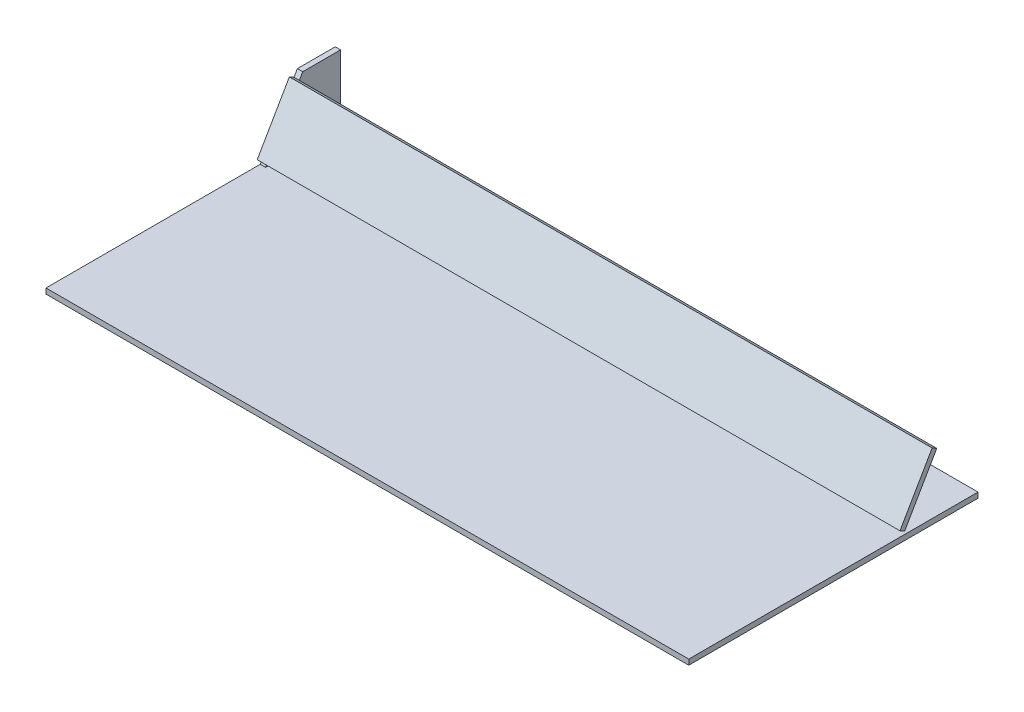
ISO-10303-21;
HEADER;
FILE_DESCRIPTION(('STEP AP214'),'2;1');
FILE_NAME('part.step','',(''),(''),'','','');
FILE_SCHEMA(('AUTOMOTIVE_DESIGN { 1 0 10303 214 1 1 1 1 }'));
ENDSEC;
DATA;
#1=APPLICATION_CONTEXT('core data for automotive mechanical design processes');
#2=APPLICATION_PROTOCOL_DEFINITION('international standard','automotive_design',2000,#1);
#3=PRODUCT_CONTEXT('',#1,'mechanical');
#4=PRODUCT('Part','Part','',(#3));
#5=PRODUCT_RELATED_PRODUCT_CATEGORY('part','',(#4));
#6=PRODUCT_DEFINITION_FORMATION('','',#4);
#7=PRODUCT_DEFINITION_CONTEXT('part definition',#1,'design');
#8=PRODUCT_DEFINITION('design','',#6,#7);
#9=PRODUCT_DEFINITION_SHAPE('','',#8);
#10=(LENGTH_UNIT() NAMED_UNIT(*) SI_UNIT(.MILLI.,.METRE.));
#11=(NAMED_UNIT(*) PLANE_ANGLE_UNIT() SI_UNIT($,.RADIAN.));
#12=(NAMED_UNIT(*) SI_UNIT($,.STERADIAN.) SOLID_ANGLE_UNIT());
#13=UNCERTAINTY_MEASURE_WITH_UNIT(LENGTH_MEASURE(1.E-05),#10,'distance_accuracy_value','');
#14=(GEOMETRIC_REPRESENTATION_CONTEXT(3) GLOBAL_UNCERTAINTY_ASSIGNED_CONTEXT((#13)) GLOBAL_UNIT_ASSIGNED_CONTEXT((#10,
#11,#12)) REPRESENTATION_CONTEXT('',''));
#15=CARTESIAN_POINT('',(0.,0.,0.));
#16=DIRECTION('',(0.,0.,1.));
#17=DIRECTION('',(1.,0.,0.));
#18=AXIS2_PLACEMENT_3D('',#15,#16,#17);
#19=CARTESIAN_POINT('',(-300.,5.,-135.));
#20=DIRECTION('',(1.,0.,0.));
#21=DIRECTION('',(0.,0.,-1.));
#22=AXIS2_PLACEMENT_3D('',#19,#20,#21);
#23=PLANE('',#22);
#24=DIRECTION('',(0.,0.,1.));
#25=VECTOR('',#24,1.);
#26=CARTESIAN_POINT('',(-300.,0.,-135.));
#27=LINE('',#26,#25);
#28=CARTESIAN_POINT('',(-300.,0.,-135.));
#29=VERTEX_POINT('',#28);
#30=CARTESIAN_POINT('',(-300.,0.,135.));
#31=VERTEX_POINT('',#30);
#32=EDGE_CURVE('E108',#29,#31,#27,.T.);
#33=ORIENTED_EDGE('',*,*,#32,.T.);
#34=DIRECTION('',(0.,-1.,0.));
#35=VECTOR('',#34,1.);
#36=CARTESIAN_POINT('',(-300.,5.,135.));
#37=LINE('',#36,#35);
#38=CARTESIAN_POINT('',(-300.,5.,135.));
#39=VERTEX_POINT('',#38);
#40=EDGE_CURVE('E12',#39,#31,#37,.T.);
#41=ORIENTED_EDGE('',*,*,#40,.F.);
#42=DIRECTION('',(0.,0.,1.));
#43=VECTOR('',#42,1.);
#44=CARTESIAN_POINT('',(-300.,5.,-135.));
#45=LINE('',#44,#43);
#46=CARTESIAN_POINT('',(-300.,5.,-135.));
#47=VERTEX_POINT('',#46);
#48=EDGE_CURVE('E96',#47,#39,#45,.T.);
#49=ORIENTED_EDGE('',*,*,#48,.F.);
#50=DIRECTION('',(0.,-1.,0.));
#51=VECTOR('',#50,1.);
#52=CARTESIAN_POINT('',(-300.,5.,-135.));
#53=LINE('',#52,#51);
#54=EDGE_CURVE('E104',#47,#29,#53,.T.);
#55=ORIENTED_EDGE('',*,*,#54,.T.);
#56=EDGE_LOOP('',(#33,#41,#49,#55));
#57=FACE_BOUND('',#56,.T.);
#58=ADVANCED_FACE('F45',(#57),#23,.F.);
#59=CARTESIAN_POINT('',(-300.,5.,135.));
#60=DIRECTION('',(0.,0.,-1.));
#61=DIRECTION('',(-1.,0.,0.));
#62=AXIS2_PLACEMENT_3D('',#59,#60,#61);
#63=PLANE('',#62);
#64=DIRECTION('',(1.,0.,0.));
#65=VECTOR('',#64,1.);
#66=CARTESIAN_POINT('',(-300.,0.,135.));
#67=LINE('',#66,#65);
#68=CARTESIAN_POINT('',(300.,0.,135.));
#69=VERTEX_POINT('',#68);
#70=EDGE_CURVE('E100',#31,#69,#67,.T.);
#71=ORIENTED_EDGE('',*,*,#70,.T.);
#72=DIRECTION('',(0.,-1.,0.));
#73=VECTOR('',#72,1.);
#74=CARTESIAN_POINT('',(300.,5.,135.));
#75=LINE('',#74,#73);
#76=CARTESIAN_POINT('',(300.,5.,135.));
#77=VERTEX_POINT('',#76);
#78=EDGE_CURVE('E53',#77,#69,#75,.T.);
#79=ORIENTED_EDGE('',*,*,#78,.F.);
#80=DIRECTION('',(1.,0.,0.));
#81=VECTOR('',#80,1.);
#82=CARTESIAN_POINT('',(-300.,5.,135.));
#83=LINE('',#82,#81);
#84=EDGE_CURVE('E91',#39,#77,#83,.T.);
#85=ORIENTED_EDGE('',*,*,#84,.F.);
#86=ORIENTED_EDGE('',*,*,#40,.T.);
#87=EDGE_LOOP('',(#71,#79,#85,#86));
#88=FACE_BOUND('',#87,.T.);
#89=ADVANCED_FACE('F99',(#88),#63,.F.);
#90=CARTESIAN_POINT('',(300.,5.,-135.));
#91=DIRECTION('',(-1.,0.,0.));
#92=DIRECTION('',(0.,0.,1.));
#93=AXIS2_PLACEMENT_3D('',#90,#91,#92);
#94=PLANE('',#93);
#95=DIRECTION('',(0.,0.,-1.));
#96=VECTOR('',#95,1.);
#97=CARTESIAN_POINT('',(300.,0.,-135.));
#98=LINE('',#97,#96);
#99=CARTESIAN_POINT('',(300.,0.,-135.));
#100=VERTEX_POINT('',#99);
#101=EDGE_CURVE('E78',#69,#100,#98,.T.);
#102=ORIENTED_EDGE('',*,*,#101,.T.);
#103=DIRECTION('',(0.,-1.,0.));
#104=VECTOR('',#103,1.);
#105=CARTESIAN_POINT('',(300.,5.,-135.));
#106=LINE('',#105,#104);
#107=CARTESIAN_POINT('',(300.,5.,-135.));
#108=VERTEX_POINT('',#107);
#109=EDGE_CURVE('E101',#108,#100,#106,.T.);
#110=ORIENTED_EDGE('',*,*,#109,.F.);
#111=DIRECTION('',(0.,0.,-1.));
#112=VECTOR('',#111,1.);
#113=CARTESIAN_POINT('',(300.,5.,-135.));
#114=LINE('',#113,#112);
#115=EDGE_CURVE('E94',#77,#108,#114,.T.);
#116=ORIENTED_EDGE('',*,*,#115,.F.);
#117=ORIENTED_EDGE('',*,*,#78,.T.);
#118=EDGE_LOOP('',(#102,#110,#116,#117));
#119=FACE_BOUND('',#118,.T.);
#120=ADVANCED_FACE('F102',(#119),#94,.F.);
#121=CARTESIAN_POINT('',(-300.,5.,-135.));
#122=DIRECTION('',(0.,0.,1.));
#123=DIRECTION('',(1.,0.,0.));
#124=AXIS2_PLACEMENT_3D('',#121,#122,#123);
#125=PLANE('',#124);
#126=DIRECTION('',(-1.,0.,0.));
#127=VECTOR('',#126,1.);
#128=CARTESIAN_POINT('',(-300.,0.,-135.));
#129=LINE('',#128,#127);
#130=EDGE_CURVE('E84',#100,#29,#129,.T.);
#131=ORIENTED_EDGE('',*,*,#130,.T.);
#132=ORIENTED_EDGE('',*,*,#54,.F.);
#133=DIRECTION('',(-1.,0.,0.));
#134=VECTOR('',#133,1.);
#135=CARTESIAN_POINT('',(-300.,5.,-135.));
#136=LINE('',#135,#134);
#137=EDGE_CURVE('E61',#108,#47,#136,.T.);
#138=ORIENTED_EDGE('',*,*,#137,.F.);
#139=ORIENTED_EDGE('',*,*,#109,.T.);
#140=EDGE_LOOP('',(#131,#132,#138,#139));
#141=FACE_BOUND('',#140,.T.);
#142=ADVANCED_FACE('F115',(#141),#125,.F.);
#143=CARTESIAN_POINT('',(0.,5.,0.));
#144=DIRECTION('',(0.,1.,0.));
#145=DIRECTION('',(0.,0.,1.));
#146=AXIS2_PLACEMENT_3D('',#143,#144,#145);
#147=PLANE('',#146);
#148=ORIENTED_EDGE('',*,*,#48,.T.);
#149=ORIENTED_EDGE('',*,*,#84,.T.);
#150=ORIENTED_EDGE('',*,*,#115,.T.);
#151=ORIENTED_EDGE('',*,*,#137,.T.);
#152=EDGE_LOOP('',(#148,#149,#150,#151));
#153=FACE_BOUND('',#152,.T.);
#154=ADVANCED_FACE('F92',(#153),#147,.T.);
#155=CARTESIAN_POINT('',(0.,0.,0.));
#156=DIRECTION('',(0.,1.,0.));
#157=DIRECTION('',(0.,0.,1.));
#158=AXIS2_PLACEMENT_3D('',#155,#156,#157);
#159=PLANE('',#158);
#160=ORIENTED_EDGE('',*,*,#32,.F.);
#161=ORIENTED_EDGE('',*,*,#130,.F.);
#162=ORIENTED_EDGE('',*,*,#101,.F.);
#163=ORIENTED_EDGE('',*,*,#70,.F.);
#164=EDGE_LOOP('',(#160,#161,#162,#163));
#165=FACE_BOUND('',#164,.T.);
#166=ADVANCED_FACE('F118',(#165),#159,.F.);
#167=CLOSED_SHELL('',(#58,#89,#120,#142,#154,#166));
#168=MANIFOLD_SOLID_BREP('B2',#167);
#169=CARTESIAN_POINT('',(364.378686242192,7.59807621135333,-66.5));
#170=DIRECTION('',(0.,-0.866025403784437,0.500000000000002));
#171=DIRECTION('',(0.,-0.500000000000002,-0.866025403784437));
#172=AXIS2_PLACEMENT_3D('',#169,#170,#171);
#173=PLANE('',#172);
#174=DIRECTION('',(0.,-0.500000000000002,-0.866025403784437));
#175=VECTOR('',#174,1.);
#176=CARTESIAN_POINT('',(300.,7.59807621135333,-66.5));
#177=LINE('',#176,#175);
#178=CARTESIAN_POINT('',(300.,10.0980762113531,-62.1698729810782));
#179=VERTEX_POINT('',#178);
#180=CARTESIAN_POINT('',(300.,7.59807621135333,-66.5));
#181=VERTEX_POINT('',#180);
#182=EDGE_CURVE('E185',#179,#181,#177,.T.);
#183=ORIENTED_EDGE('',*,*,#182,.F.);
#184=DIRECTION('',(-1.,0.,0.));
#185=VECTOR('',#184,1.);
#186=CARTESIAN_POINT('',(364.378686242192,10.0980762113531,-62.1698729810782));
#187=LINE('',#186,#185);
#188=CARTESIAN_POINT('',(-300.,10.0980762113531,-62.1698729810782));
#189=VERTEX_POINT('',#188);
#190=EDGE_CURVE('E211',#179,#189,#187,.T.);
#191=ORIENTED_EDGE('',*,*,#190,.T.);
#192=DIRECTION('',(0.,0.500000000000002,0.866025403784437));
#193=VECTOR('',#192,1.);
#194=CARTESIAN_POINT('',(-300.,7.59807621135333,-66.5));
#195=LINE('',#194,#193);
#196=CARTESIAN_POINT('',(-300.,7.59807621135333,-66.5));
#197=VERTEX_POINT('',#196);
#198=EDGE_CURVE('E215',#197,#189,#195,.T.);
#199=ORIENTED_EDGE('',*,*,#198,.F.);
#200=DIRECTION('',(-1.,0.,0.));
#201=VECTOR('',#200,1.);
#202=CARTESIAN_POINT('',(364.378686242192,7.59807621135333,-66.5));
#203=LINE('',#202,#201);
#204=EDGE_CURVE('E237',#181,#197,#203,.T.);
#205=ORIENTED_EDGE('',*,*,#204,.F.);
#206=EDGE_LOOP('',(#183,#191,#199,#205));
#207=FACE_BOUND('',#206,.T.);
#208=ADVANCED_FACE('F177',(#207),#173,.T.);
#209=CARTESIAN_POINT('',(364.378686242192,59.5596004384197,-96.4999999999999));
#210=DIRECTION('',(0.,-0.499999999999998,-0.86602540378444));
#211=DIRECTION('',(0.,0.86602540378444,-0.499999999999998));
#212=AXIS2_PLACEMENT_3D('',#209,#210,#211);
#213=PLANE('',#212);
#214=DIRECTION('',(0.,0.86602540378444,-0.499999999999998));
#215=VECTOR('',#214,1.);
#216=CARTESIAN_POINT('',(300.,59.5596004384197,-96.4999999999999));
#217=LINE('',#216,#215);
#218=CARTESIAN_POINT('',(300.,59.5596004384197,-96.4999999999999));
#219=VERTEX_POINT('',#218);
#220=EDGE_CURVE('E249',#181,#219,#217,.T.);
#221=ORIENTED_EDGE('',*,*,#220,.F.);
#222=ORIENTED_EDGE('',*,*,#204,.T.);
#223=DIRECTION('',(0.,-0.86602540378444,0.499999999999998));
#224=VECTOR('',#223,1.);
#225=CARTESIAN_POINT('',(-300.,59.5596004384197,-96.4999999999999));
#226=LINE('',#225,#224);
#227=CARTESIAN_POINT('',(-300.,59.5596004384197,-96.4999999999999));
#228=VERTEX_POINT('',#227);
#229=EDGE_CURVE('E219',#228,#197,#226,.T.);
#230=ORIENTED_EDGE('',*,*,#229,.F.);
#231=DIRECTION('',(-1.,0.,0.));
#232=VECTOR('',#231,1.);
#233=CARTESIAN_POINT('',(364.378686242192,59.5596004384197,-96.4999999999999));
#234=LINE('',#233,#232);
#235=EDGE_CURVE('E240',#219,#228,#234,.T.);
#236=ORIENTED_EDGE('',*,*,#235,.F.);
#237=EDGE_LOOP('',(#221,#222,#230,#236));
#238=FACE_BOUND('',#237,.T.);
#239=ADVANCED_FACE('F248',(#238),#213,.T.);
#240=CARTESIAN_POINT('',(364.378686242192,62.0596004384197,-92.1698729810777));
#241=DIRECTION('',(0.,0.866025403784441,-0.499999999999997));
#242=DIRECTION('',(0.,0.499999999999997,0.866025403784441));
#243=AXIS2_PLACEMENT_3D('',#240,#241,#242);
#244=PLANE('',#243);
#245=DIRECTION('',(0.,0.499999999999997,0.866025403784441));
#246=VECTOR('',#245,1.);
#247=CARTESIAN_POINT('',(300.,62.0596004384197,-92.1698729810777));
#248=LINE('',#247,#246);
#249=CARTESIAN_POINT('',(300.,62.0596004384197,-92.1698729810777));
#250=VERTEX_POINT('',#249);
#251=EDGE_CURVE('E239',#219,#250,#248,.T.);
#252=ORIENTED_EDGE('',*,*,#251,.F.);
#253=ORIENTED_EDGE('',*,*,#235,.T.);
#254=DIRECTION('',(0.,-0.499999999999997,-0.866025403784441));
#255=VECTOR('',#254,1.);
#256=CARTESIAN_POINT('',(-300.,62.0596004384197,-92.1698729810777));
#257=LINE('',#256,#255);
#258=CARTESIAN_POINT('',(-300.,62.0596004384197,-92.1698729810777));
#259=VERTEX_POINT('',#258);
#260=EDGE_CURVE('E227',#259,#228,#257,.T.);
#261=ORIENTED_EDGE('',*,*,#260,.F.);
#262=DIRECTION('',(-1.,0.,0.));
#263=VECTOR('',#262,1.);
#264=CARTESIAN_POINT('',(364.378686242192,62.0596004384197,-92.1698729810777));
#265=LINE('',#264,#263);
#266=EDGE_CURVE('E218',#250,#259,#265,.T.);
#267=ORIENTED_EDGE('',*,*,#266,.F.);
#268=EDGE_LOOP('',(#252,#253,#261,#267));
#269=FACE_BOUND('',#268,.T.);
#270=ADVANCED_FACE('F245',(#269),#244,.T.);
#271=CARTESIAN_POINT('',(364.378686242192,10.0980762113531,-62.1698729810782));
#272=DIRECTION('',(0.,0.499999999999991,0.866025403784444));
#273=DIRECTION('',(0.,-0.866025403784444,0.499999999999991));
#274=AXIS2_PLACEMENT_3D('',#271,#272,#273);
#275=PLANE('',#274);
#276=DIRECTION('',(0.,-0.866025403784444,0.499999999999991));
#277=VECTOR('',#276,1.);
#278=CARTESIAN_POINT('',(300.,10.0980762113531,-62.1698729810782));
#279=LINE('',#278,#277);
#280=EDGE_CURVE('E43',#250,#179,#279,.T.);
#281=ORIENTED_EDGE('',*,*,#280,.F.);
#282=ORIENTED_EDGE('',*,*,#266,.T.);
#283=DIRECTION('',(0.,0.866025403784444,-0.499999999999991));
#284=VECTOR('',#283,1.);
#285=CARTESIAN_POINT('',(-300.,10.0980762113531,-62.1698729810782));
#286=LINE('',#285,#284);
#287=EDGE_CURVE('E221',#189,#259,#286,.T.);
#288=ORIENTED_EDGE('',*,*,#287,.F.);
#289=ORIENTED_EDGE('',*,*,#190,.F.);
#290=EDGE_LOOP('',(#281,#282,#288,#289));
#291=FACE_BOUND('',#290,.T.);
#292=ADVANCED_FACE('F222',(#291),#275,.T.);
#293=CARTESIAN_POINT('',(-300.,0.,0.));
#294=DIRECTION('',(-1.,0.,0.));
#295=DIRECTION('',(0.,0.,1.));
#296=AXIS2_PLACEMENT_3D('',#293,#294,#295);
#297=PLANE('',#296);
#298=ORIENTED_EDGE('',*,*,#198,.T.);
#299=ORIENTED_EDGE('',*,*,#287,.T.);
#300=ORIENTED_EDGE('',*,*,#260,.T.);
#301=ORIENTED_EDGE('',*,*,#229,.T.);
#302=EDGE_LOOP('',(#298,#299,#300,#301));
#303=FACE_BOUND('',#302,.T.);
#304=ADVANCED_FACE('F229',(#303),#297,.T.);
#305=CARTESIAN_POINT('',(300.,5.,-135.));
#306=DIRECTION('',(-1.,0.,0.));
#307=DIRECTION('',(0.,0.,1.));
#308=AXIS2_PLACEMENT_3D('',#305,#306,#307);
#309=PLANE('',#308);
#310=ORIENTED_EDGE('',*,*,#182,.T.);
#311=ORIENTED_EDGE('',*,*,#220,.T.);
#312=ORIENTED_EDGE('',*,*,#251,.T.);
#313=ORIENTED_EDGE('',*,*,#280,.T.);
#314=EDGE_LOOP('',(#310,#311,#312,#313));
#315=FACE_BOUND('',#314,.T.);
#316=ADVANCED_FACE('F250',(#315),#309,.F.);
#317=CLOSED_SHELL('',(#208,#239,#270,#292,#304,#316));
#318=MANIFOLD_SOLID_BREP('B6',#317);
#319=CARTESIAN_POINT('',(-295.,5.,-135.));
#320=DIRECTION('',(0.,0.,-1.));
#321=DIRECTION('',(-1.,0.,0.));
#322=AXIS2_PLACEMENT_3D('',#319,#320,#321);
#323=PLANE('',#322);
#324=DIRECTION('',(0.,-1.,0.));
#325=VECTOR('',#324,1.);
#326=CARTESIAN_POINT('',(-300.,5.,-135.));
#327=LINE('',#326,#325);
#328=CARTESIAN_POINT('',(-300.,65.,-135.));
#329=VERTEX_POINT('',#328);
#330=CARTESIAN_POINT('',(-300.,5.,-135.));
#331=VERTEX_POINT('',#330);
#332=EDGE_CURVE('E364',#329,#331,#327,.T.);
#333=ORIENTED_EDGE('',*,*,#332,.F.);
#334=DIRECTION('',(-1.,0.,0.));
#335=VECTOR('',#334,1.);
#336=CARTESIAN_POINT('',(-295.,65.,-135.));
#337=LINE('',#336,#335);
#338=CARTESIAN_POINT('',(-295.,65.,-135.));
#339=VERTEX_POINT('',#338);
#340=EDGE_CURVE('E175',#339,#329,#337,.T.);
#341=ORIENTED_EDGE('',*,*,#340,.F.);
#342=DIRECTION('',(0.,-1.,0.));
#343=VECTOR('',#342,1.);
#344=CARTESIAN_POINT('',(-295.,5.,-135.));
#345=LINE('',#344,#343);
#346=CARTESIAN_POINT('',(-295.,5.,-135.));
#347=VERTEX_POINT('',#346);
#348=EDGE_CURVE('E358',#339,#347,#345,.T.);
#349=ORIENTED_EDGE('',*,*,#348,.T.);
#350=DIRECTION('',(-1.,0.,0.));
#351=VECTOR('',#350,1.);
#352=CARTESIAN_POINT('',(-295.,5.,-135.));
#353=LINE('',#352,#351);
#354=EDGE_CURVE('E303',#347,#331,#353,.T.);
#355=ORIENTED_EDGE('',*,*,#354,.T.);
#356=EDGE_LOOP('',(#333,#341,#349,#355));
#357=FACE_BOUND('',#356,.T.);
#358=ADVANCED_FACE('F300',(#357),#323,.T.);
#359=CARTESIAN_POINT('',(-295.,65.,-135.));
#360=DIRECTION('',(0.,1.,0.));
#361=DIRECTION('',(0.,0.,1.));
#362=AXIS2_PLACEMENT_3D('',#359,#360,#361);
#363=PLANE('',#362);
#364=DIRECTION('',(0.,0.,-1.));
#365=VECTOR('',#364,1.);
#366=CARTESIAN_POINT('',(-300.,65.,-135.));
#367=LINE('',#366,#365);
#368=CARTESIAN_POINT('',(-300.,65.,-99.6410161513774));
#369=VERTEX_POINT('',#368);
#370=EDGE_CURVE('E360',#369,#329,#367,.T.);
#371=ORIENTED_EDGE('',*,*,#370,.F.);
#372=DIRECTION('',(-1.,0.,0.));
#373=VECTOR('',#372,1.);
#374=CARTESIAN_POINT('',(-295.,65.,-99.6410161513774));
#375=LINE('',#374,#373);
#376=CARTESIAN_POINT('',(-295.,65.,-99.6410161513774));
#377=VERTEX_POINT('',#376);
#378=EDGE_CURVE('E309',#377,#369,#375,.T.);
#379=ORIENTED_EDGE('',*,*,#378,.F.);
#380=DIRECTION('',(0.,0.,-1.));
#381=VECTOR('',#380,1.);
#382=CARTESIAN_POINT('',(-295.,65.,-135.));
#383=LINE('',#382,#381);
#384=EDGE_CURVE('E355',#377,#339,#383,.T.);
#385=ORIENTED_EDGE('',*,*,#384,.T.);
#386=ORIENTED_EDGE('',*,*,#340,.T.);
#387=EDGE_LOOP('',(#371,#379,#385,#386));
#388=FACE_BOUND('',#387,.T.);
#389=ADVANCED_FACE('F374',(#388),#363,.T.);
#390=CARTESIAN_POINT('',(-295.,65.,-99.6410161513774));
#391=DIRECTION('',(0.,0.499999999999998,0.86602540378444));
#392=DIRECTION('',(0.,-0.86602540378444,0.499999999999998));
#393=AXIS2_PLACEMENT_3D('',#390,#391,#392);
#394=PLANE('',#393);
#395=DIRECTION('',(0.,0.86602540378444,-0.499999999999998));
#396=VECTOR('',#395,1.);
#397=CARTESIAN_POINT('',(-300.,65.,-99.6410161513774));
#398=LINE('',#397,#396);
#399=CARTESIAN_POINT('',(-300.,5.,-65.));
#400=VERTEX_POINT('',#399);
#401=EDGE_CURVE('E350',#400,#369,#398,.T.);
#402=ORIENTED_EDGE('',*,*,#401,.F.);
#403=DIRECTION('',(-1.,0.,0.));
#404=VECTOR('',#403,1.);
#405=CARTESIAN_POINT('',(-295.,5.,-65.));
#406=LINE('',#405,#404);
#407=CARTESIAN_POINT('',(-295.,5.,-65.));
#408=VERTEX_POINT('',#407);
#409=EDGE_CURVE('E345',#408,#400,#406,.T.);
#410=ORIENTED_EDGE('',*,*,#409,.F.);
#411=DIRECTION('',(0.,0.86602540378444,-0.499999999999998));
#412=VECTOR('',#411,1.);
#413=CARTESIAN_POINT('',(-295.,65.,-99.6410161513774));
#414=LINE('',#413,#412);
#415=EDGE_CURVE('E348',#408,#377,#414,.T.);
#416=ORIENTED_EDGE('',*,*,#415,.T.);
#417=ORIENTED_EDGE('',*,*,#378,.T.);
#418=EDGE_LOOP('',(#402,#410,#416,#417));
#419=FACE_BOUND('',#418,.T.);
#420=ADVANCED_FACE('F347',(#419),#394,.T.);
#421=CARTESIAN_POINT('',(-295.,5.,-135.));
#422=DIRECTION('',(0.,-1.,0.));
#423=DIRECTION('',(0.,0.,-1.));
#424=AXIS2_PLACEMENT_3D('',#421,#422,#423);
#425=PLANE('',#424);
#426=DIRECTION('',(0.,0.,1.));
#427=VECTOR('',#426,1.);
#428=CARTESIAN_POINT('',(-300.,5.,-135.));
#429=LINE('',#428,#427);
#430=EDGE_CURVE('E367',#331,#400,#429,.T.);
#431=ORIENTED_EDGE('',*,*,#430,.F.);
#432=ORIENTED_EDGE('',*,*,#354,.F.);
#433=DIRECTION('',(0.,0.,1.));
#434=VECTOR('',#433,1.);
#435=CARTESIAN_POINT('',(-295.,5.,-135.));
#436=LINE('',#435,#434);
#437=EDGE_CURVE('E354',#347,#408,#436,.T.);
#438=ORIENTED_EDGE('',*,*,#437,.T.);
#439=ORIENTED_EDGE('',*,*,#409,.T.);
#440=EDGE_LOOP('',(#431,#432,#438,#439));
#441=FACE_BOUND('',#440,.T.);
#442=ADVANCED_FACE('F357',(#441),#425,.T.);
#443=CARTESIAN_POINT('',(-295.,0.,0.));
#444=DIRECTION('',(1.,0.,0.));
#445=DIRECTION('',(0.,0.,-1.));
#446=AXIS2_PLACEMENT_3D('',#443,#444,#445);
#447=PLANE('',#446);
#448=ORIENTED_EDGE('',*,*,#348,.F.);
#449=ORIENTED_EDGE('',*,*,#384,.F.);
#450=ORIENTED_EDGE('',*,*,#415,.F.);
#451=ORIENTED_EDGE('',*,*,#437,.F.);
#452=EDGE_LOOP('',(#448,#449,#450,#451));
#453=FACE_BOUND('',#452,.T.);
#454=ADVANCED_FACE('F353',(#453),#447,.T.);
#455=CARTESIAN_POINT('',(-300.,0.,0.));
#456=DIRECTION('',(1.,0.,0.));
#457=DIRECTION('',(0.,0.,-1.));
#458=AXIS2_PLACEMENT_3D('',#455,#456,#457);
#459=PLANE('',#458);
#460=ORIENTED_EDGE('',*,*,#332,.T.);
#461=ORIENTED_EDGE('',*,*,#430,.T.);
#462=ORIENTED_EDGE('',*,*,#401,.T.);
#463=ORIENTED_EDGE('',*,*,#370,.T.);
#464=EDGE_LOOP('',(#460,#461,#462,#463));
#465=FACE_BOUND('',#464,.T.);
#466=ADVANCED_FACE('F373',(#465),#459,.F.);
#467=CLOSED_SHELL('',(#358,#389,#420,#442,#454,#466));
#468=MANIFOLD_SOLID_BREP('B37',#467);
#469=ADVANCED_BREP_SHAPE_REPRESENTATION('',(#18,#168,#318,#468),#14);
#470=SHAPE_DEFINITION_REPRESENTATION(#9,#469);
ENDSEC;
END-ISO-10303-21;
